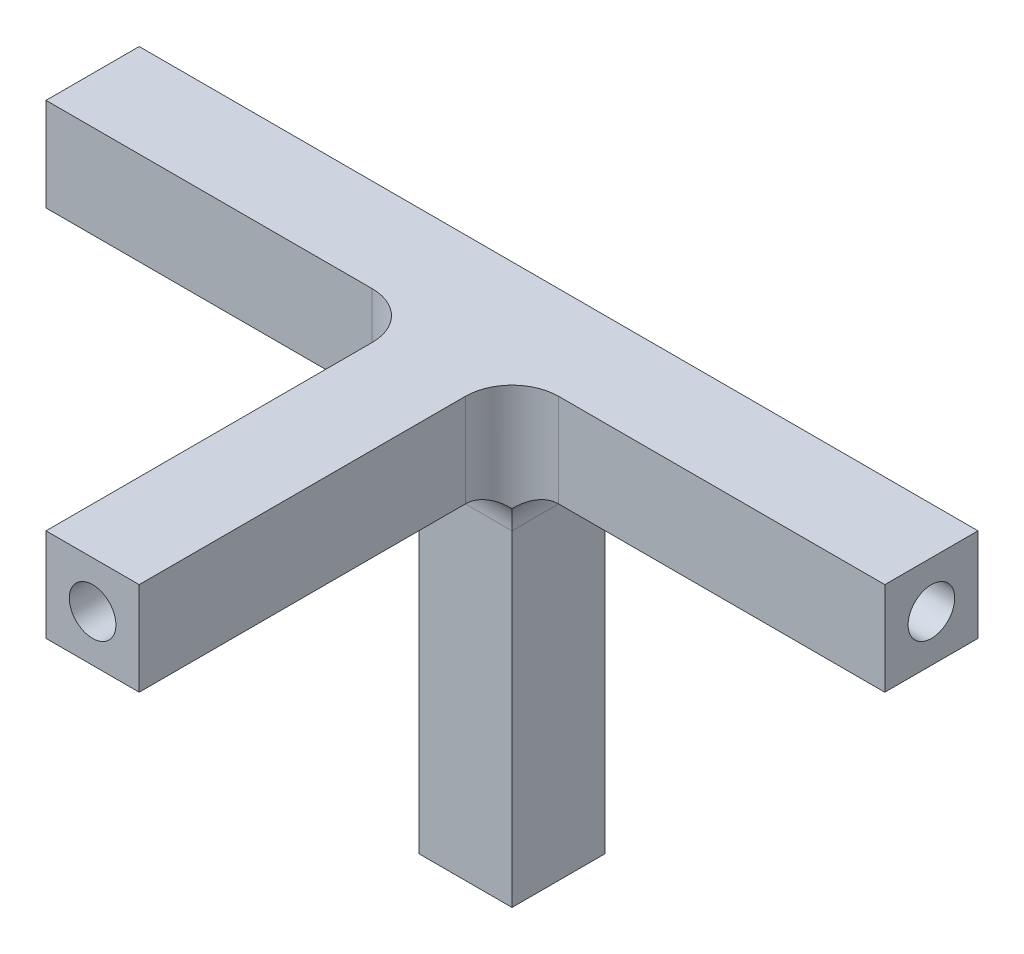
ISO-10303-21;
HEADER;
FILE_DESCRIPTION(('STEP AP214'),'2;1');
FILE_NAME('part.step','',(''),(''),'','','');
FILE_SCHEMA(('AUTOMOTIVE_DESIGN { 1 0 10303 214 1 1 1 1 }'));
ENDSEC;
DATA;
#1=APPLICATION_CONTEXT('core data for automotive mechanical design processes');
#2=APPLICATION_PROTOCOL_DEFINITION('international standard','automotive_design',2000,#1);
#3=PRODUCT_CONTEXT('',#1,'mechanical');
#4=PRODUCT('Part','Part','',(#3));
#5=PRODUCT_RELATED_PRODUCT_CATEGORY('part','',(#4));
#6=PRODUCT_DEFINITION_FORMATION('','',#4);
#7=PRODUCT_DEFINITION_CONTEXT('part definition',#1,'design');
#8=PRODUCT_DEFINITION('design','',#6,#7);
#9=PRODUCT_DEFINITION_SHAPE('','',#8);
#10=(LENGTH_UNIT() NAMED_UNIT(*) SI_UNIT(.MILLI.,.METRE.));
#11=(NAMED_UNIT(*) PLANE_ANGLE_UNIT() SI_UNIT($,.RADIAN.));
#12=(NAMED_UNIT(*) SI_UNIT($,.STERADIAN.) SOLID_ANGLE_UNIT());
#13=UNCERTAINTY_MEASURE_WITH_UNIT(LENGTH_MEASURE(1.E-05),#10,'distance_accuracy_value','');
#14=(GEOMETRIC_REPRESENTATION_CONTEXT(3) GLOBAL_UNCERTAINTY_ASSIGNED_CONTEXT((#13)) GLOBAL_UNIT_ASSIGNED_CONTEXT((#10,
#11,#12)) REPRESENTATION_CONTEXT('',''));
#15=CARTESIAN_POINT('',(0.,0.,0.));
#16=DIRECTION('',(0.,0.,1.));
#17=DIRECTION('',(1.,0.,0.));
#18=AXIS2_PLACEMENT_3D('',#15,#16,#17);
#19=CARTESIAN_POINT('',(0.,0.,1.));
#20=DIRECTION('',(0.,0.,-1.));
#21=DIRECTION('',(-1.,0.,0.));
#22=AXIS2_PLACEMENT_3D('',#19,#20,#21);
#23=PLANE('',#22);
#24=DIRECTION('',(-1.,0.,0.));
#25=VECTOR('',#24,1.);
#26=CARTESIAN_POINT('',(-9.,1.,1.));
#27=LINE('',#26,#25);
#28=CARTESIAN_POINT('',(9.,1.,1.));
#29=VERTEX_POINT('',#28);
#30=CARTESIAN_POINT('',(2.,1.,1.));
#31=VERTEX_POINT('',#30);
#32=EDGE_CURVE('E255',#29,#31,#27,.T.);
#33=ORIENTED_EDGE('',*,*,#32,.T.);
#34=DIRECTION('',(0.,1.,0.));
#35=VECTOR('',#34,1.);
#36=CARTESIAN_POINT('',(2.,-1.,1.));
#37=LINE('',#36,#35);
#38=CARTESIAN_POINT('',(2.,-1.,1.));
#39=VERTEX_POINT('',#38);
#40=EDGE_CURVE('E343',#31,#39,#37,.F.);
#41=ORIENTED_EDGE('',*,*,#40,.T.);
#42=DIRECTION('',(1.,0.,0.));
#43=VECTOR('',#42,1.);
#44=CARTESIAN_POINT('',(9.,-1.,1.));
#45=LINE('',#44,#43);
#46=CARTESIAN_POINT('',(9.,-1.,1.));
#47=VERTEX_POINT('',#46);
#48=EDGE_CURVE('E248',#39,#47,#45,.T.);
#49=ORIENTED_EDGE('',*,*,#48,.T.);
#50=DIRECTION('',(0.,1.,0.));
#51=VECTOR('',#50,1.);
#52=CARTESIAN_POINT('',(9.,1.,1.));
#53=LINE('',#52,#51);
#54=EDGE_CURVE('E251',#47,#29,#53,.T.);
#55=ORIENTED_EDGE('',*,*,#54,.T.);
#56=EDGE_LOOP('',(#33,#41,#49,#55));
#57=FACE_BOUND('',#56,.T.);
#58=ADVANCED_FACE('F39',(#57),#23,.F.);
#59=DIRECTION('',(1.,0.,0.));
#60=VECTOR('',#59,1.);
#61=CARTESIAN_POINT('',(-1.,-1.,1.));
#62=LINE('',#61,#60);
#63=CARTESIAN_POINT('',(-9.,-1.,1.));
#64=VERTEX_POINT('',#63);
#65=CARTESIAN_POINT('',(-2.,-1.,1.));
#66=VERTEX_POINT('',#65);
#67=EDGE_CURVE('E233',#64,#66,#62,.T.);
#68=ORIENTED_EDGE('',*,*,#67,.T.);
#69=DIRECTION('',(0.,1.,0.));
#70=VECTOR('',#69,1.);
#71=CARTESIAN_POINT('',(-2.,0.,1.));
#72=LINE('',#71,#70);
#73=CARTESIAN_POINT('',(-2.,1.,1.));
#74=VERTEX_POINT('',#73);
#75=EDGE_CURVE('E339',#66,#74,#72,.T.);
#76=ORIENTED_EDGE('',*,*,#75,.T.);
#77=CARTESIAN_POINT('',(-9.,1.,1.));
#78=VERTEX_POINT('',#77);
#79=EDGE_CURVE('E254',#74,#78,#27,.T.);
#80=ORIENTED_EDGE('',*,*,#79,.T.);
#81=DIRECTION('',(0.,-1.,0.));
#82=VECTOR('',#81,1.);
#83=CARTESIAN_POINT('',(-9.,-1.,1.));
#84=LINE('',#83,#82);
#85=EDGE_CURVE('E229',#78,#64,#84,.T.);
#86=ORIENTED_EDGE('',*,*,#85,.T.);
#87=EDGE_LOOP('',(#68,#76,#80,#86));
#88=FACE_BOUND('',#87,.T.);
#89=ADVANCED_FACE('F438',(#88),#23,.F.);
#90=CARTESIAN_POINT('',(-9.,-1.,1.));
#91=DIRECTION('',(1.,0.,0.));
#92=DIRECTION('',(0.,0.,-1.));
#93=AXIS2_PLACEMENT_3D('',#90,#91,#92);
#94=PLANE('',#93);
#95=CARTESIAN_POINT('',(-9.,0.,0.));
#96=DIRECTION('',(1.,0.,0.));
#97=DIRECTION('',(0.,0.,-1.));
#98=AXIS2_PLACEMENT_3D('',#95,#96,#97);
#99=CIRCLE('',#98,0.5);
#100=CARTESIAN_POINT('',(-9.,0.,-0.5));
#101=VERTEX_POINT('',#100);
#102=EDGE_CURVE('E224',#101,#101,#99,.T.);
#103=ORIENTED_EDGE('',*,*,#102,.T.);
#104=EDGE_LOOP('',(#103));
#105=FACE_BOUND('',#104,.T.);
#106=DIRECTION('',(0.,-1.,0.));
#107=VECTOR('',#106,1.);
#108=CARTESIAN_POINT('',(-9.,-1.,-1.));
#109=LINE('',#108,#107);
#110=CARTESIAN_POINT('',(-9.,1.,-1.));
#111=VERTEX_POINT('',#110);
#112=CARTESIAN_POINT('',(-9.,-1.,-1.));
#113=VERTEX_POINT('',#112);
#114=EDGE_CURVE('E228',#111,#113,#109,.T.);
#115=ORIENTED_EDGE('',*,*,#114,.T.);
#116=DIRECTION('',(0.,0.,-1.));
#117=VECTOR('',#116,1.);
#118=CARTESIAN_POINT('',(-9.,-1.,1.));
#119=LINE('',#118,#117);
#120=EDGE_CURVE('E304',#64,#113,#119,.T.);
#121=ORIENTED_EDGE('',*,*,#120,.F.);
#122=ORIENTED_EDGE('',*,*,#85,.F.);
#123=DIRECTION('',(0.,0.,-1.));
#124=VECTOR('',#123,1.);
#125=CARTESIAN_POINT('',(-9.,1.,1.));
#126=LINE('',#125,#124);
#127=EDGE_CURVE('E259',#78,#111,#126,.T.);
#128=ORIENTED_EDGE('',*,*,#127,.T.);
#129=EDGE_LOOP('',(#115,#121,#122,#128));
#130=FACE_BOUND('',#129,.T.);
#131=ADVANCED_FACE('F404',(#105,#130),#94,.F.);
#132=CARTESIAN_POINT('',(-1.,-1.,1.));
#133=DIRECTION('',(0.,1.,0.));
#134=DIRECTION('',(0.,0.,1.));
#135=AXIS2_PLACEMENT_3D('',#132,#133,#134);
#136=PLANE('',#135);
#137=DIRECTION('',(1.,0.,0.));
#138=VECTOR('',#137,1.);
#139=CARTESIAN_POINT('',(-1.,-1.,-1.));
#140=LINE('',#139,#138);
#141=CARTESIAN_POINT('',(-2.,-1.,-1.));
#142=VERTEX_POINT('',#141);
#143=EDGE_CURVE('E263',#113,#142,#140,.T.);
#144=ORIENTED_EDGE('',*,*,#143,.T.);
#145=DIRECTION('',(0.,0.,-1.));
#146=VECTOR('',#145,1.);
#147=CARTESIAN_POINT('',(-2.,-1.,1.));
#148=LINE('',#147,#146);
#149=EDGE_CURVE('E317',#142,#66,#148,.F.);
#150=ORIENTED_EDGE('',*,*,#149,.T.);
#151=ORIENTED_EDGE('',*,*,#67,.F.);
#152=ORIENTED_EDGE('',*,*,#120,.T.);
#153=EDGE_LOOP('',(#144,#150,#151,#152));
#154=FACE_BOUND('',#153,.T.);
#155=ADVANCED_FACE('F400',(#154),#136,.F.);
#156=CARTESIAN_POINT('',(-1.,-9.,1.));
#157=DIRECTION('',(1.,0.,0.));
#158=DIRECTION('',(0.,0.,-1.));
#159=AXIS2_PLACEMENT_3D('',#156,#157,#158);
#160=PLANE('',#159);
#161=DIRECTION('',(0.,-1.,0.));
#162=VECTOR('',#161,1.);
#163=CARTESIAN_POINT('',(-1.,-9.,1.));
#164=LINE('',#163,#162);
#165=CARTESIAN_POINT('',(-1.,-2.,1.));
#166=VERTEX_POINT('',#165);
#167=CARTESIAN_POINT('',(-1.,-9.,1.));
#168=VERTEX_POINT('',#167);
#169=EDGE_CURVE('E238',#166,#168,#164,.T.);
#170=ORIENTED_EDGE('',*,*,#169,.F.);
#171=DIRECTION('',(0.,0.,-1.));
#172=VECTOR('',#171,1.);
#173=CARTESIAN_POINT('',(-1.,-2.,-1.));
#174=LINE('',#173,#172);
#175=CARTESIAN_POINT('',(-1.,-2.,-1.));
#176=VERTEX_POINT('',#175);
#177=EDGE_CURVE('E313',#166,#176,#174,.T.);
#178=ORIENTED_EDGE('',*,*,#177,.T.);
#179=DIRECTION('',(0.,-1.,0.));
#180=VECTOR('',#179,1.);
#181=CARTESIAN_POINT('',(-1.,-9.,-1.));
#182=LINE('',#181,#180);
#183=CARTESIAN_POINT('',(-1.,-9.,-1.));
#184=VERTEX_POINT('',#183);
#185=EDGE_CURVE('E267',#176,#184,#182,.T.);
#186=ORIENTED_EDGE('',*,*,#185,.T.);
#187=DIRECTION('',(0.,0.,-1.));
#188=VECTOR('',#187,1.);
#189=CARTESIAN_POINT('',(-1.,-9.,1.));
#190=LINE('',#189,#188);
#191=EDGE_CURVE('E300',#168,#184,#190,.T.);
#192=ORIENTED_EDGE('',*,*,#191,.F.);
#193=EDGE_LOOP('',(#170,#178,#186,#192));
#194=FACE_BOUND('',#193,.T.);
#195=ADVANCED_FACE('F390',(#194),#160,.F.);
#196=CARTESIAN_POINT('',(1.,-9.,1.));
#197=DIRECTION('',(0.,1.,0.));
#198=DIRECTION('',(0.,0.,1.));
#199=AXIS2_PLACEMENT_3D('',#196,#197,#198);
#200=PLANE('',#199);
#201=CARTESIAN_POINT('',(0.,-9.,0.));
#202=DIRECTION('',(0.,1.,0.));
#203=DIRECTION('',(0.,0.,1.));
#204=AXIS2_PLACEMENT_3D('',#201,#202,#203);
#205=CIRCLE('',#204,0.5);
#206=CARTESIAN_POINT('',(0.,-9.,0.5));
#207=VERTEX_POINT('',#206);
#208=EDGE_CURVE('E216',#207,#207,#205,.F.);
#209=ORIENTED_EDGE('',*,*,#208,.F.);
#210=EDGE_LOOP('',(#209));
#211=FACE_BOUND('',#210,.T.);
#212=DIRECTION('',(1.,0.,0.));
#213=VECTOR('',#212,1.);
#214=CARTESIAN_POINT('',(1.,-9.,-1.));
#215=LINE('',#214,#213);
#216=CARTESIAN_POINT('',(1.,-9.,-1.));
#217=VERTEX_POINT('',#216);
#218=EDGE_CURVE('E270',#184,#217,#215,.T.);
#219=ORIENTED_EDGE('',*,*,#218,.T.);
#220=DIRECTION('',(0.,0.,-1.));
#221=VECTOR('',#220,1.);
#222=CARTESIAN_POINT('',(1.,-9.,1.));
#223=LINE('',#222,#221);
#224=CARTESIAN_POINT('',(1.,-9.,1.));
#225=VERTEX_POINT('',#224);
#226=EDGE_CURVE('E296',#225,#217,#223,.T.);
#227=ORIENTED_EDGE('',*,*,#226,.F.);
#228=DIRECTION('',(1.,0.,0.));
#229=VECTOR('',#228,1.);
#230=CARTESIAN_POINT('',(1.,-9.,1.));
#231=LINE('',#230,#229);
#232=EDGE_CURVE('E241',#168,#225,#231,.T.);
#233=ORIENTED_EDGE('',*,*,#232,.F.);
#234=ORIENTED_EDGE('',*,*,#191,.T.);
#235=EDGE_LOOP('',(#219,#227,#233,#234));
#236=FACE_BOUND('',#235,.T.);
#237=ADVANCED_FACE('F426',(#211,#236),#200,.F.);
#238=CARTESIAN_POINT('',(1.,-1.,1.));
#239=DIRECTION('',(-1.,0.,0.));
#240=DIRECTION('',(0.,0.,1.));
#241=AXIS2_PLACEMENT_3D('',#238,#239,#240);
#242=PLANE('',#241);
#243=DIRECTION('',(0.,1.,0.));
#244=VECTOR('',#243,1.);
#245=CARTESIAN_POINT('',(1.,-1.,-1.));
#246=LINE('',#245,#244);
#247=CARTESIAN_POINT('',(1.,-2.,-1.));
#248=VERTEX_POINT('',#247);
#249=EDGE_CURVE('E273',#217,#248,#246,.T.);
#250=ORIENTED_EDGE('',*,*,#249,.T.);
#251=DIRECTION('',(0.,0.,-1.));
#252=VECTOR('',#251,1.);
#253=CARTESIAN_POINT('',(1.,-2.,1.));
#254=LINE('',#253,#252);
#255=CARTESIAN_POINT('',(1.,-2.,1.));
#256=VERTEX_POINT('',#255);
#257=EDGE_CURVE('E325',#248,#256,#254,.F.);
#258=ORIENTED_EDGE('',*,*,#257,.T.);
#259=DIRECTION('',(0.,1.,0.));
#260=VECTOR('',#259,1.);
#261=CARTESIAN_POINT('',(1.,-1.,1.));
#262=LINE('',#261,#260);
#263=EDGE_CURVE('E244',#225,#256,#262,.T.);
#264=ORIENTED_EDGE('',*,*,#263,.F.);
#265=ORIENTED_EDGE('',*,*,#226,.T.);
#266=EDGE_LOOP('',(#250,#258,#264,#265));
#267=FACE_BOUND('',#266,.T.);
#268=ADVANCED_FACE('F423',(#267),#242,.F.);
#269=CARTESIAN_POINT('',(9.,-1.,1.));
#270=DIRECTION('',(0.,1.,0.));
#271=DIRECTION('',(0.,0.,1.));
#272=AXIS2_PLACEMENT_3D('',#269,#270,#271);
#273=PLANE('',#272);
#274=ORIENTED_EDGE('',*,*,#48,.F.);
#275=DIRECTION('',(0.,0.,-1.));
#276=VECTOR('',#275,1.);
#277=CARTESIAN_POINT('',(2.,-1.,-1.));
#278=LINE('',#277,#276);
#279=CARTESIAN_POINT('',(2.,-1.,-1.));
#280=VERTEX_POINT('',#279);
#281=EDGE_CURVE('E321',#39,#280,#278,.T.);
#282=ORIENTED_EDGE('',*,*,#281,.T.);
#283=DIRECTION('',(1.,0.,0.));
#284=VECTOR('',#283,1.);
#285=CARTESIAN_POINT('',(9.,-1.,-1.));
#286=LINE('',#285,#284);
#287=CARTESIAN_POINT('',(9.,-1.,-1.));
#288=VERTEX_POINT('',#287);
#289=EDGE_CURVE('E277',#280,#288,#286,.T.);
#290=ORIENTED_EDGE('',*,*,#289,.T.);
#291=DIRECTION('',(0.,0.,-1.));
#292=VECTOR('',#291,1.);
#293=CARTESIAN_POINT('',(9.,-1.,1.));
#294=LINE('',#293,#292);
#295=EDGE_CURVE('E292',#47,#288,#294,.T.);
#296=ORIENTED_EDGE('',*,*,#295,.F.);
#297=EDGE_LOOP('',(#274,#282,#290,#296));
#298=FACE_BOUND('',#297,.T.);
#299=ADVANCED_FACE('F420',(#298),#273,.F.);
#300=CARTESIAN_POINT('',(9.,1.,1.));
#301=DIRECTION('',(-1.,0.,0.));
#302=DIRECTION('',(0.,0.,1.));
#303=AXIS2_PLACEMENT_3D('',#300,#301,#302);
#304=PLANE('',#303);
#305=CARTESIAN_POINT('',(9.,0.,0.));
#306=DIRECTION('',(1.,0.,0.));
#307=DIRECTION('',(0.,0.,-1.));
#308=AXIS2_PLACEMENT_3D('',#305,#306,#307);
#309=CIRCLE('',#308,0.5);
#310=CARTESIAN_POINT('',(9.,0.,-0.5));
#311=VERTEX_POINT('',#310);
#312=EDGE_CURVE('E220',#311,#311,#309,.T.);
#313=ORIENTED_EDGE('',*,*,#312,.F.);
#314=EDGE_LOOP('',(#313));
#315=FACE_BOUND('',#314,.T.);
#316=DIRECTION('',(0.,1.,0.));
#317=VECTOR('',#316,1.);
#318=CARTESIAN_POINT('',(9.,1.,-1.));
#319=LINE('',#318,#317);
#320=CARTESIAN_POINT('',(9.,1.,-1.));
#321=VERTEX_POINT('',#320);
#322=EDGE_CURVE('E280',#288,#321,#319,.T.);
#323=ORIENTED_EDGE('',*,*,#322,.T.);
#324=DIRECTION('',(0.,0.,-1.));
#325=VECTOR('',#324,1.);
#326=CARTESIAN_POINT('',(9.,1.,1.));
#327=LINE('',#326,#325);
#328=EDGE_CURVE('E288',#29,#321,#327,.T.);
#329=ORIENTED_EDGE('',*,*,#328,.F.);
#330=ORIENTED_EDGE('',*,*,#54,.F.);
#331=ORIENTED_EDGE('',*,*,#295,.T.);
#332=EDGE_LOOP('',(#323,#329,#330,#331));
#333=FACE_BOUND('',#332,.T.);
#334=ADVANCED_FACE('F416',(#315,#333),#304,.F.);
#335=CARTESIAN_POINT('',(-9.,1.,1.));
#336=DIRECTION('',(0.,-1.,0.));
#337=DIRECTION('',(0.,0.,-1.));
#338=AXIS2_PLACEMENT_3D('',#335,#336,#337);
#339=PLANE('',#338);
#340=DIRECTION('',(-1.,0.,0.));
#341=VECTOR('',#340,1.);
#342=CARTESIAN_POINT('',(-9.,1.,-1.));
#343=LINE('',#342,#341);
#344=EDGE_CURVE('E234',#321,#111,#343,.T.);
#345=ORIENTED_EDGE('',*,*,#344,.T.);
#346=ORIENTED_EDGE('',*,*,#127,.F.);
#347=ORIENTED_EDGE('',*,*,#79,.F.);
#348=CARTESIAN_POINT('',(-2.,1.,2.));
#349=DIRECTION('',(0.,-1.,0.));
#350=DIRECTION('',(0.,0.,-1.));
#351=AXIS2_PLACEMENT_3D('',#348,#349,#350);
#352=CIRCLE('',#351,1.);
#353=CARTESIAN_POINT('',(-1.,1.,2.));
#354=VERTEX_POINT('',#353);
#355=EDGE_CURVE('E354',#74,#354,#352,.T.);
#356=ORIENTED_EDGE('',*,*,#355,.T.);
#357=DIRECTION('',(0.,0.,-1.));
#358=VECTOR('',#357,1.);
#359=CARTESIAN_POINT('',(-1.,1.,9.));
#360=LINE('',#359,#358);
#361=CARTESIAN_POINT('',(-1.,1.,9.));
#362=VERTEX_POINT('',#361);
#363=EDGE_CURVE('E204',#362,#354,#360,.T.);
#364=ORIENTED_EDGE('',*,*,#363,.F.);
#365=DIRECTION('',(-1.,0.,0.));
#366=VECTOR('',#365,1.);
#367=CARTESIAN_POINT('',(0.,1.,9.));
#368=LINE('',#367,#366);
#369=CARTESIAN_POINT('',(0.999999999999999,1.,9.));
#370=VERTEX_POINT('',#369);
#371=EDGE_CURVE('E193',#370,#362,#368,.T.);
#372=ORIENTED_EDGE('',*,*,#371,.F.);
#373=DIRECTION('',(0.,0.,-1.));
#374=VECTOR('',#373,1.);
#375=CARTESIAN_POINT('',(0.999999999999999,1.,9.));
#376=LINE('',#375,#374);
#377=CARTESIAN_POINT('',(0.999999999999999,1.,2.));
#378=VERTEX_POINT('',#377);
#379=EDGE_CURVE('E208',#370,#378,#376,.T.);
#380=ORIENTED_EDGE('',*,*,#379,.T.);
#381=CARTESIAN_POINT('',(2.,1.,2.));
#382=DIRECTION('',(0.,-1.,0.));
#383=DIRECTION('',(0.,0.,-1.));
#384=AXIS2_PLACEMENT_3D('',#381,#382,#383);
#385=CIRCLE('',#384,1.);
#386=EDGE_CURVE('E351',#378,#31,#385,.T.);
#387=ORIENTED_EDGE('',*,*,#386,.T.);
#388=ORIENTED_EDGE('',*,*,#32,.F.);
#389=ORIENTED_EDGE('',*,*,#328,.T.);
#390=EDGE_LOOP('',(#345,#346,#347,#356,#364,#372,#380,#387,#388,#389));
#391=FACE_BOUND('',#390,.T.);
#392=ADVANCED_FACE('F410',(#391),#339,.F.);
#393=ORIENTED_EDGE('',*,*,#263,.T.);
#394=DIRECTION('',(1.,0.,0.));
#395=VECTOR('',#394,1.);
#396=CARTESIAN_POINT('',(-2.,-2.,1.));
#397=LINE('',#396,#395);
#398=EDGE_CURVE('E361',#256,#166,#397,.F.);
#399=ORIENTED_EDGE('',*,*,#398,.T.);
#400=ORIENTED_EDGE('',*,*,#169,.T.);
#401=ORIENTED_EDGE('',*,*,#232,.T.);
#402=EDGE_LOOP('',(#393,#399,#400,#401));
#403=FACE_BOUND('',#402,.T.);
#404=ADVANCED_FACE('F386',(#403),#23,.F.);
#405=CARTESIAN_POINT('',(0.,0.,-1.));
#406=DIRECTION('',(0.,0.,-1.));
#407=DIRECTION('',(-1.,0.,0.));
#408=AXIS2_PLACEMENT_3D('',#405,#406,#407);
#409=PLANE('',#408);
#410=ORIENTED_EDGE('',*,*,#114,.F.);
#411=ORIENTED_EDGE('',*,*,#344,.F.);
#412=ORIENTED_EDGE('',*,*,#322,.F.);
#413=ORIENTED_EDGE('',*,*,#289,.F.);
#414=CARTESIAN_POINT('',(2.,-2.,-1.));
#415=DIRECTION('',(0.,0.,-1.));
#416=DIRECTION('',(-1.,0.,0.));
#417=AXIS2_PLACEMENT_3D('',#414,#415,#416);
#418=CIRCLE('',#417,1.);
#419=EDGE_CURVE('E332',#280,#248,#418,.F.);
#420=ORIENTED_EDGE('',*,*,#419,.T.);
#421=ORIENTED_EDGE('',*,*,#249,.F.);
#422=ORIENTED_EDGE('',*,*,#218,.F.);
#423=ORIENTED_EDGE('',*,*,#185,.F.);
#424=CARTESIAN_POINT('',(-2.,-2.,-1.));
#425=DIRECTION('',(0.,0.,-1.));
#426=DIRECTION('',(-1.,0.,0.));
#427=AXIS2_PLACEMENT_3D('',#424,#425,#426);
#428=CIRCLE('',#427,1.);
#429=EDGE_CURVE('E329',#176,#142,#428,.F.);
#430=ORIENTED_EDGE('',*,*,#429,.T.);
#431=ORIENTED_EDGE('',*,*,#143,.F.);
#432=EDGE_LOOP('',(#410,#411,#412,#413,#420,#421,#422,#423,#430,#431));
#433=FACE_BOUND('',#432,.T.);
#434=ADVANCED_FACE('F397',(#433),#409,.T.);
#435=CARTESIAN_POINT('',(-9.,0.,0.));
#436=DIRECTION('',(1.,0.,0.));
#437=DIRECTION('',(0.,0.,-1.));
#438=AXIS2_PLACEMENT_3D('',#435,#436,#437);
#439=CYLINDRICAL_SURFACE('',#438,0.5);
#440=CARTESIAN_POINT('',(0.,0.,0.));
#441=DIRECTION('',(0.707106781186547,0.,-0.707106781186547));
#442=DIRECTION('',(0.707106781186547,0.,0.707106781186547));
#443=AXIS2_PLACEMENT_3D('',#440,#441,#442);
#444=ELLIPSE('',#443,0.707106781186547,0.5);
#445=CARTESIAN_POINT('',(0.353553390593274,-0.353553390593274,0.353553390593274));
#446=VERTEX_POINT('',#445);
#447=CARTESIAN_POINT('',(0.,0.5,0.));
#448=VERTEX_POINT('',#447);
#449=EDGE_CURVE('E167',#446,#448,#444,.F.);
#450=ORIENTED_EDGE('',*,*,#449,.T.);
#451=CARTESIAN_POINT('',(0.,0.,0.));
#452=DIRECTION('',(0.707106781186547,0.,0.707106781186547));
#453=DIRECTION('',(0.707106781186547,0.,-0.707106781186547));
#454=AXIS2_PLACEMENT_3D('',#451,#452,#453);
#455=ELLIPSE('',#454,0.707106781186547,0.5);
#456=CARTESIAN_POINT('',(-0.353553390593274,-0.353553390593274,0.353553390593274));
#457=VERTEX_POINT('',#456);
#458=EDGE_CURVE('E164',#448,#457,#455,.T.);
#459=ORIENTED_EDGE('',*,*,#458,.T.);
#460=CARTESIAN_POINT('',(0.,0.,0.));
#461=DIRECTION('',(0.707106781186547,-0.707106781186547,0.));
#462=DIRECTION('',(0.707106781186547,0.707106781186547,0.));
#463=AXIS2_PLACEMENT_3D('',#460,#461,#462);
#464=ELLIPSE('',#463,0.707106781186547,0.5);
#465=CARTESIAN_POINT('',(0.,0.,-0.5));
#466=VERTEX_POINT('',#465);
#467=EDGE_CURVE('E308',#457,#466,#464,.T.);
#468=ORIENTED_EDGE('',*,*,#467,.T.);
#469=CARTESIAN_POINT('',(0.,0.,0.));
#470=DIRECTION('',(0.707106781186547,0.707106781186547,0.));
#471=DIRECTION('',(0.707106781186547,-0.707106781186547,0.));
#472=AXIS2_PLACEMENT_3D('',#469,#470,#471);
#473=ELLIPSE('',#472,0.707106781186547,0.5);
#474=EDGE_CURVE('E179',#466,#446,#473,.F.);
#475=ORIENTED_EDGE('',*,*,#474,.T.);
#476=EDGE_LOOP('',(#450,#459,#468,#475));
#477=FACE_BOUND('',#476,.T.);
#478=ORIENTED_EDGE('',*,*,#102,.F.);
#479=EDGE_LOOP('',(#478));
#480=FACE_BOUND('',#479,.T.);
#481=ORIENTED_EDGE('',*,*,#312,.T.);
#482=EDGE_LOOP('',(#481));
#483=FACE_BOUND('',#482,.T.);
#484=ADVANCED_FACE('F176',(#477,#480,#483),#439,.F.);
#485=CARTESIAN_POINT('',(0.,-10.4142135623731,0.));
#486=DIRECTION('',(0.,1.,0.));
#487=DIRECTION('',(0.,0.,1.));
#488=AXIS2_PLACEMENT_3D('',#485,#486,#487);
#489=CYLINDRICAL_SURFACE('',#488,0.5);
#490=ORIENTED_EDGE('',*,*,#208,.T.);
#491=EDGE_LOOP('',(#490));
#492=FACE_BOUND('',#491,.T.);
#493=ORIENTED_EDGE('',*,*,#467,.F.);
#494=CARTESIAN_POINT('',(0.,0.,0.));
#495=DIRECTION('',(0.,0.707106781186547,0.707106781186547));
#496=DIRECTION('',(0.,0.707106781186547,-0.707106781186547));
#497=AXIS2_PLACEMENT_3D('',#494,#495,#496);
#498=ELLIPSE('',#497,0.707106781186547,0.5);
#499=EDGE_CURVE('E169',#457,#446,#498,.T.);
#500=ORIENTED_EDGE('',*,*,#499,.T.);
#501=ORIENTED_EDGE('',*,*,#474,.F.);
#502=EDGE_LOOP('',(#493,#500,#501));
#503=FACE_BOUND('',#502,.T.);
#504=ADVANCED_FACE('F489',(#492,#503),#489,.F.);
#505=CARTESIAN_POINT('',(0.,-1.,9.));
#506=DIRECTION('',(0.,1.,0.));
#507=DIRECTION('',(0.,0.,1.));
#508=AXIS2_PLACEMENT_3D('',#505,#506,#507);
#509=PLANE('',#508);
#510=DIRECTION('',(0.,0.,-1.));
#511=VECTOR('',#510,1.);
#512=CARTESIAN_POINT('',(-1.,-0.999999999999999,9.));
#513=LINE('',#512,#511);
#514=CARTESIAN_POINT('',(-1.,-0.999999999999999,9.));
#515=VERTEX_POINT('',#514);
#516=CARTESIAN_POINT('',(-1.,-0.999999999999999,2.));
#517=VERTEX_POINT('',#516);
#518=EDGE_CURVE('E200',#515,#517,#513,.T.);
#519=ORIENTED_EDGE('',*,*,#518,.T.);
#520=DIRECTION('',(1.,0.,0.));
#521=VECTOR('',#520,1.);
#522=CARTESIAN_POINT('',(2.,-1.,2.));
#523=LINE('',#522,#521);
#524=CARTESIAN_POINT('',(0.999999999999999,-1.,2.));
#525=VERTEX_POINT('',#524);
#526=EDGE_CURVE('E357',#517,#525,#523,.T.);
#527=ORIENTED_EDGE('',*,*,#526,.T.);
#528=DIRECTION('',(0.,0.,-1.));
#529=VECTOR('',#528,1.);
#530=CARTESIAN_POINT('',(0.999999999999999,-1.,9.));
#531=LINE('',#530,#529);
#532=CARTESIAN_POINT('',(0.999999999999999,-1.,9.));
#533=VERTEX_POINT('',#532);
#534=EDGE_CURVE('E212',#533,#525,#531,.T.);
#535=ORIENTED_EDGE('',*,*,#534,.F.);
#536=DIRECTION('',(1.,0.,0.));
#537=VECTOR('',#536,1.);
#538=CARTESIAN_POINT('',(0.,-1.,9.));
#539=LINE('',#538,#537);
#540=EDGE_CURVE('E173',#515,#533,#539,.T.);
#541=ORIENTED_EDGE('',*,*,#540,.F.);
#542=EDGE_LOOP('',(#519,#527,#535,#541));
#543=FACE_BOUND('',#542,.T.);
#544=ADVANCED_FACE('F498',(#543),#509,.F.);
#545=CARTESIAN_POINT('',(1.,0.,9.));
#546=DIRECTION('',(-1.,0.,0.));
#547=DIRECTION('',(0.,-1.,0.));
#548=AXIS2_PLACEMENT_3D('',#545,#546,#547);
#549=PLANE('',#548);
#550=ORIENTED_EDGE('',*,*,#534,.T.);
#551=DIRECTION('',(0.,1.,0.));
#552=VECTOR('',#551,1.);
#553=CARTESIAN_POINT('',(0.999999999999999,1.,2.));
#554=LINE('',#553,#552);
#555=EDGE_CURVE('E335',#525,#378,#554,.T.);
#556=ORIENTED_EDGE('',*,*,#555,.T.);
#557=ORIENTED_EDGE('',*,*,#379,.F.);
#558=DIRECTION('',(0.,1.,0.));
#559=VECTOR('',#558,1.);
#560=CARTESIAN_POINT('',(1.,0.,9.));
#561=LINE('',#560,#559);
#562=EDGE_CURVE('E190',#533,#370,#561,.T.);
#563=ORIENTED_EDGE('',*,*,#562,.F.);
#564=EDGE_LOOP('',(#550,#556,#557,#563));
#565=FACE_BOUND('',#564,.T.);
#566=ADVANCED_FACE('F572',(#565),#549,.F.);
#567=CARTESIAN_POINT('',(-1.,0.,9.));
#568=DIRECTION('',(-1.,0.,0.));
#569=DIRECTION('',(0.,0.,1.));
#570=AXIS2_PLACEMENT_3D('',#567,#568,#569);
#571=PLANE('',#570);
#572=ORIENTED_EDGE('',*,*,#363,.T.);
#573=DIRECTION('',(0.,1.,0.));
#574=VECTOR('',#573,1.);
#575=CARTESIAN_POINT('',(-1.,0.,2.));
#576=LINE('',#575,#574);
#577=EDGE_CURVE('E347',#354,#517,#576,.F.);
#578=ORIENTED_EDGE('',*,*,#577,.T.);
#579=ORIENTED_EDGE('',*,*,#518,.F.);
#580=DIRECTION('',(0.,1.,0.));
#581=VECTOR('',#580,1.);
#582=CARTESIAN_POINT('',(-1.,0.,9.));
#583=LINE('',#582,#581);
#584=EDGE_CURVE('E196',#515,#362,#583,.T.);
#585=ORIENTED_EDGE('',*,*,#584,.T.);
#586=EDGE_LOOP('',(#572,#578,#579,#585));
#587=FACE_BOUND('',#586,.T.);
#588=ADVANCED_FACE('F511',(#587),#571,.T.);
#589=CARTESIAN_POINT('',(0.,0.,9.));
#590=DIRECTION('',(0.,0.,1.));
#591=DIRECTION('',(1.,0.,0.));
#592=AXIS2_PLACEMENT_3D('',#589,#590,#591);
#593=PLANE('',#592);
#594=CARTESIAN_POINT('',(0.,0.,9.));
#595=DIRECTION('',(0.,0.,1.));
#596=DIRECTION('',(1.,0.,0.));
#597=AXIS2_PLACEMENT_3D('',#594,#595,#596);
#598=CIRCLE('',#597,0.5);
#599=CARTESIAN_POINT('',(0.5,0.,9.));
#600=VERTEX_POINT('',#599);
#601=EDGE_CURVE('E183',#600,#600,#598,.T.);
#602=ORIENTED_EDGE('',*,*,#601,.F.);
#603=EDGE_LOOP('',(#602));
#604=FACE_BOUND('',#603,.T.);
#605=ORIENTED_EDGE('',*,*,#540,.T.);
#606=ORIENTED_EDGE('',*,*,#562,.T.);
#607=ORIENTED_EDGE('',*,*,#371,.T.);
#608=ORIENTED_EDGE('',*,*,#584,.F.);
#609=EDGE_LOOP('',(#605,#606,#607,#608));
#610=FACE_BOUND('',#609,.T.);
#611=ADVANCED_FACE('F506',(#604,#610),#593,.T.);
#612=CARTESIAN_POINT('',(0.,0.,0.));
#613=DIRECTION('',(0.,0.,1.));
#614=DIRECTION('',(1.,0.,0.));
#615=AXIS2_PLACEMENT_3D('',#612,#613,#614);
#616=CYLINDRICAL_SURFACE('',#615,0.5);
#617=ORIENTED_EDGE('',*,*,#601,.T.);
#618=EDGE_LOOP('',(#617));
#619=FACE_BOUND('',#618,.T.);
#620=ORIENTED_EDGE('',*,*,#449,.F.);
#621=ORIENTED_EDGE('',*,*,#499,.F.);
#622=ORIENTED_EDGE('',*,*,#458,.F.);
#623=EDGE_LOOP('',(#620,#621,#622));
#624=FACE_BOUND('',#623,.T.);
#625=ADVANCED_FACE('F166',(#619,#624),#616,.F.);
#626=CARTESIAN_POINT('',(-2.,-2.,1.));
#627=DIRECTION('',(0.,0.,1.));
#628=DIRECTION('',(1.,0.,0.));
#629=AXIS2_PLACEMENT_3D('',#626,#627,#628);
#630=CYLINDRICAL_SURFACE('',#629,1.);
#631=ORIENTED_EDGE('',*,*,#177,.F.);
#632=CARTESIAN_POINT('',(-2.,-2.,2.));
#633=DIRECTION('',(0.707106781186547,0.,0.707106781186547));
#634=DIRECTION('',(-0.707106781186547,0.,0.707106781186547));
#635=AXIS2_PLACEMENT_3D('',#632,#633,#634);
#636=ELLIPSE('',#635,1.41421356237309,1.);
#637=CARTESIAN_POINT('',(-1.29289321881345,-1.29289321881345,1.29289321881345));
#638=VERTEX_POINT('',#637);
#639=EDGE_CURVE('E55',#166,#638,#636,.T.);
#640=ORIENTED_EDGE('',*,*,#639,.T.);
#641=CARTESIAN_POINT('',(-2.,-2.,2.));
#642=DIRECTION('',(0.,0.707106781186547,0.707106781186547));
#643=DIRECTION('',(0.,0.707106781186547,-0.707106781186547));
#644=AXIS2_PLACEMENT_3D('',#641,#642,#643);
#645=ELLIPSE('',#644,1.41421356237309,1.);
#646=EDGE_CURVE('E11',#66,#638,#645,.F.);
#647=ORIENTED_EDGE('',*,*,#646,.F.);
#648=ORIENTED_EDGE('',*,*,#149,.F.);
#649=ORIENTED_EDGE('',*,*,#429,.F.);
#650=EDGE_LOOP('',(#631,#640,#647,#648,#649));
#651=FACE_BOUND('',#650,.T.);
#652=ADVANCED_FACE('F393',(#651),#630,.F.);
#653=CARTESIAN_POINT('',(2.,-2.,1.));
#654=DIRECTION('',(0.,0.,1.));
#655=DIRECTION('',(1.,0.,0.));
#656=AXIS2_PLACEMENT_3D('',#653,#654,#655);
#657=CYLINDRICAL_SURFACE('',#656,1.);
#658=ORIENTED_EDGE('',*,*,#281,.F.);
#659=CARTESIAN_POINT('',(2.,-2.,2.));
#660=DIRECTION('',(0.,0.707106781186547,0.707106781186547));
#661=DIRECTION('',(0.,-0.707106781186547,0.707106781186547));
#662=AXIS2_PLACEMENT_3D('',#659,#660,#661);
#663=ELLIPSE('',#662,1.41421356237309,1.);
#664=CARTESIAN_POINT('',(1.29289321881345,-1.29289321881345,1.29289321881345));
#665=VERTEX_POINT('',#664);
#666=EDGE_CURVE('E48',#39,#665,#663,.T.);
#667=ORIENTED_EDGE('',*,*,#666,.T.);
#668=CARTESIAN_POINT('',(2.,-2.,2.));
#669=DIRECTION('',(-0.707106781186547,0.,0.707106781186547));
#670=DIRECTION('',(0.707106781186547,0.,0.707106781186547));
#671=AXIS2_PLACEMENT_3D('',#668,#669,#670);
#672=ELLIPSE('',#671,1.41421356237309,1.);
#673=EDGE_CURVE('E366',#665,#256,#672,.T.);
#674=ORIENTED_EDGE('',*,*,#673,.T.);
#675=ORIENTED_EDGE('',*,*,#257,.F.);
#676=ORIENTED_EDGE('',*,*,#419,.F.);
#677=EDGE_LOOP('',(#658,#667,#674,#675,#676));
#678=FACE_BOUND('',#677,.T.);
#679=ADVANCED_FACE('F377',(#678),#657,.F.);
#680=CARTESIAN_POINT('',(2.,0.,2.));
#681=DIRECTION('',(0.,-1.,0.));
#682=DIRECTION('',(1.,0.,0.));
#683=AXIS2_PLACEMENT_3D('',#680,#681,#682);
#684=CYLINDRICAL_SURFACE('',#683,1.);
#685=ORIENTED_EDGE('',*,*,#555,.F.);
#686=CARTESIAN_POINT('',(2.,-2.,2.));
#687=DIRECTION('',(-0.707106781186547,-0.707106781186548,0.));
#688=DIRECTION('',(0.707106781186548,-0.707106781186547,0.));
#689=AXIS2_PLACEMENT_3D('',#686,#687,#688);
#690=ELLIPSE('',#689,1.4142135623731,1.);
#691=EDGE_CURVE('E62',#525,#665,#690,.T.);
#692=ORIENTED_EDGE('',*,*,#691,.T.);
#693=ORIENTED_EDGE('',*,*,#666,.F.);
#694=ORIENTED_EDGE('',*,*,#40,.F.);
#695=ORIENTED_EDGE('',*,*,#386,.F.);
#696=EDGE_LOOP('',(#685,#692,#693,#694,#695));
#697=FACE_BOUND('',#696,.T.);
#698=ADVANCED_FACE('F603',(#697),#684,.F.);
#699=CARTESIAN_POINT('',(-2.,0.,2.));
#700=DIRECTION('',(0.,1.,0.));
#701=DIRECTION('',(0.,0.,1.));
#702=AXIS2_PLACEMENT_3D('',#699,#700,#701);
#703=CYLINDRICAL_SURFACE('',#702,1.);
#704=ORIENTED_EDGE('',*,*,#75,.F.);
#705=ORIENTED_EDGE('',*,*,#646,.T.);
#706=CARTESIAN_POINT('',(-2.,-2.,2.));
#707=DIRECTION('',(-0.707106781186547,0.707106781186547,0.));
#708=DIRECTION('',(0.707106781186547,0.707106781186547,0.));
#709=AXIS2_PLACEMENT_3D('',#706,#707,#708);
#710=ELLIPSE('',#709,1.41421356237309,1.);
#711=EDGE_CURVE('E371',#638,#517,#710,.F.);
#712=ORIENTED_EDGE('',*,*,#711,.T.);
#713=ORIENTED_EDGE('',*,*,#577,.F.);
#714=ORIENTED_EDGE('',*,*,#355,.F.);
#715=EDGE_LOOP('',(#704,#705,#712,#713,#714));
#716=FACE_BOUND('',#715,.T.);
#717=ADVANCED_FACE('F611',(#716),#703,.F.);
#718=CARTESIAN_POINT('',(0.,-2.,2.));
#719=DIRECTION('',(-1.,0.,0.));
#720=DIRECTION('',(0.,0.,1.));
#721=AXIS2_PLACEMENT_3D('',#718,#719,#720);
#722=CYLINDRICAL_SURFACE('',#721,1.);
#723=ORIENTED_EDGE('',*,*,#639,.F.);
#724=ORIENTED_EDGE('',*,*,#398,.F.);
#725=ORIENTED_EDGE('',*,*,#673,.F.);
#726=ORIENTED_EDGE('',*,*,#691,.F.);
#727=ORIENTED_EDGE('',*,*,#526,.F.);
#728=ORIENTED_EDGE('',*,*,#711,.F.);
#729=EDGE_LOOP('',(#723,#724,#725,#726,#727,#728));
#730=FACE_BOUND('',#729,.T.);
#731=ADVANCED_FACE('F41',(#730),#722,.F.);
#732=CLOSED_SHELL('',(#58,#89,#131,#155,#195,#237,#268,#299,#334,#392,#404,#434,#484,#504,#544,
#566,#588,#611,#625,#652,#679,#698,#717,#731));
#733=MANIFOLD_SOLID_BREP('B2',#732);
#734=ADVANCED_BREP_SHAPE_REPRESENTATION('',(#18,#733),#14);
#735=SHAPE_DEFINITION_REPRESENTATION(#9,#734);
ENDSEC;
END-ISO-10303-21;
